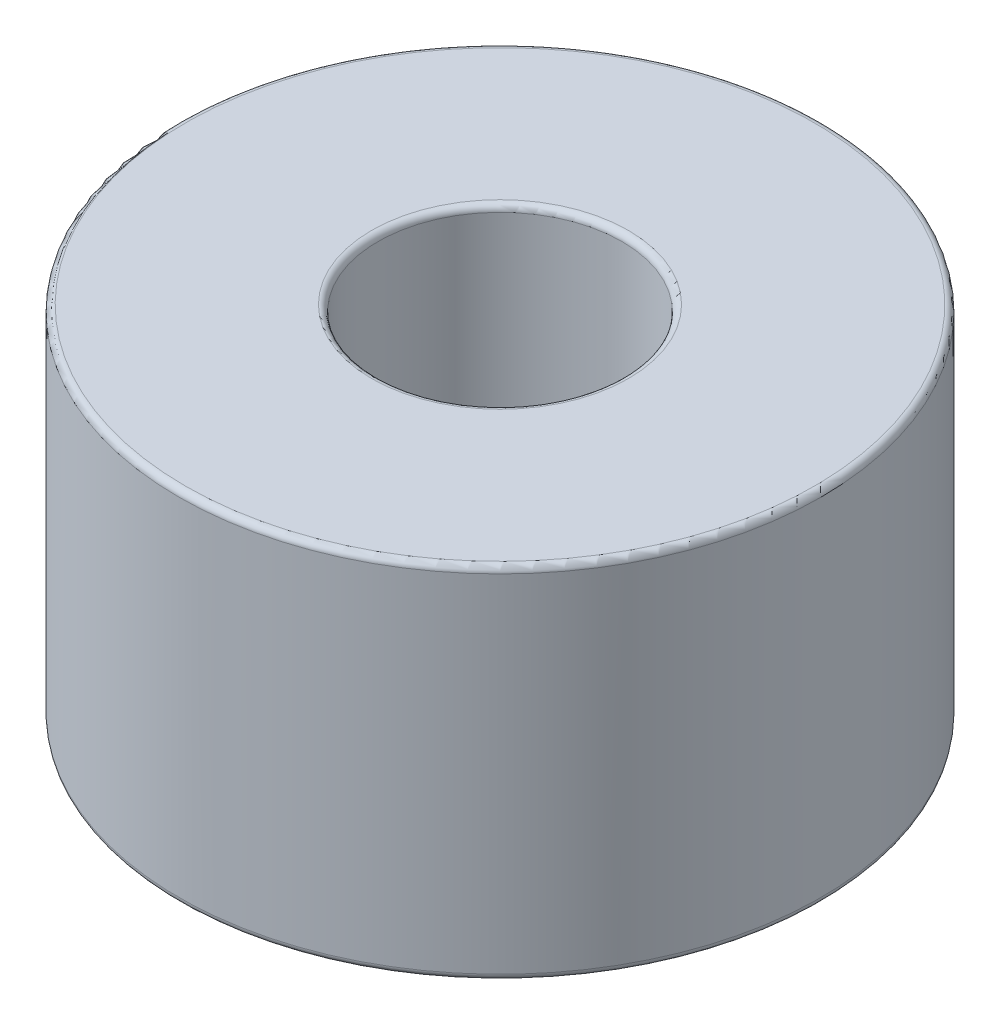
ISO-10303-21;
HEADER;
FILE_DESCRIPTION(('STEP AP214'),'2;1');
FILE_NAME('part.step','',(''),(''),'','','');
FILE_SCHEMA(('AUTOMOTIVE_DESIGN { 1 0 10303 214 1 1 1 1 }'));
ENDSEC;
DATA;
#1=APPLICATION_CONTEXT('core data for automotive mechanical design processes');
#2=APPLICATION_PROTOCOL_DEFINITION('international standard','automotive_design',2000,#1);
#3=PRODUCT_CONTEXT('',#1,'mechanical');
#4=PRODUCT('Part','Part','',(#3));
#5=PRODUCT_RELATED_PRODUCT_CATEGORY('part','',(#4));
#6=PRODUCT_DEFINITION_FORMATION('','',#4);
#7=PRODUCT_DEFINITION_CONTEXT('part definition',#1,'design');
#8=PRODUCT_DEFINITION('design','',#6,#7);
#9=PRODUCT_DEFINITION_SHAPE('','',#8);
#10=(LENGTH_UNIT() NAMED_UNIT(*) SI_UNIT(.MILLI.,.METRE.));
#11=(NAMED_UNIT(*) PLANE_ANGLE_UNIT() SI_UNIT($,.RADIAN.));
#12=(NAMED_UNIT(*) SI_UNIT($,.STERADIAN.) SOLID_ANGLE_UNIT());
#13=UNCERTAINTY_MEASURE_WITH_UNIT(LENGTH_MEASURE(1.E-05),#10,'distance_accuracy_value','');
#14=(GEOMETRIC_REPRESENTATION_CONTEXT(3) GLOBAL_UNCERTAINTY_ASSIGNED_CONTEXT((#13)) GLOBAL_UNIT_ASSIGNED_CONTEXT((#10,
#11,#12)) REPRESENTATION_CONTEXT('',''));
#15=CARTESIAN_POINT('',(0.,0.,0.));
#16=DIRECTION('',(0.,0.,1.));
#17=DIRECTION('',(1.,0.,0.));
#18=AXIS2_PLACEMENT_3D('',#15,#16,#17);
#19=CARTESIAN_POINT('',(0.,0.,0.));
#20=DIRECTION('',(0.,-1.,0.));
#21=DIRECTION('',(0.,0.,-1.));
#22=AXIS2_PLACEMENT_3D('',#19,#20,#21);
#23=CYLINDRICAL_SURFACE('',#22,4.75);
#24=CARTESIAN_POINT('',(0.,0.25,0.));
#25=DIRECTION('',(0.,-1.,0.));
#26=DIRECTION('',(0.,0.,-1.));
#27=AXIS2_PLACEMENT_3D('',#24,#25,#26);
#28=CIRCLE('',#27,4.75);
#29=CARTESIAN_POINT('',(0.,0.25,-4.75));
#30=VERTEX_POINT('',#29);
#31=EDGE_CURVE('E41',#30,#30,#28,.T.);
#32=ORIENTED_EDGE('',*,*,#31,.T.);
#33=EDGE_LOOP('',(#32));
#34=FACE_BOUND('',#33,.T.);
#35=CARTESIAN_POINT('',(0.,13.75,0.));
#36=DIRECTION('',(0.,1.,0.));
#37=DIRECTION('',(0.,0.,1.));
#38=AXIS2_PLACEMENT_3D('',#35,#36,#37);
#39=CIRCLE('',#38,4.75);
#40=CARTESIAN_POINT('',(0.,13.75,4.75));
#41=VERTEX_POINT('',#40);
#42=EDGE_CURVE('E45',#41,#41,#39,.T.);
#43=ORIENTED_EDGE('',*,*,#42,.T.);
#44=EDGE_LOOP('',(#43));
#45=FACE_BOUND('',#44,.T.);
#46=ADVANCED_FACE('F30',(#34,#45),#23,.F.);
#47=CARTESIAN_POINT('',(4.75,0.,0.));
#48=DIRECTION('',(0.,-1.,0.));
#49=DIRECTION('',(0.,0.,-1.));
#50=AXIS2_PLACEMENT_3D('',#47,#48,#49);
#51=PLANE('',#50);
#52=CARTESIAN_POINT('',(0.,0.,0.));
#53=DIRECTION('',(0.,-1.,0.));
#54=DIRECTION('',(0.,0.,-1.));
#55=AXIS2_PLACEMENT_3D('',#52,#53,#54);
#56=CIRCLE('',#55,12.25);
#57=CARTESIAN_POINT('',(0.,0.,-12.25));
#58=VERTEX_POINT('',#57);
#59=EDGE_CURVE('E56',#58,#58,#56,.T.);
#60=ORIENTED_EDGE('',*,*,#59,.T.);
#61=EDGE_LOOP('',(#60));
#62=FACE_BOUND('',#61,.T.);
#63=CARTESIAN_POINT('',(0.,0.,0.));
#64=DIRECTION('',(0.,-1.,0.));
#65=DIRECTION('',(0.,0.,-1.));
#66=AXIS2_PLACEMENT_3D('',#63,#64,#65);
#67=CIRCLE('',#66,5.);
#68=CARTESIAN_POINT('',(0.,0.,-5.));
#69=VERTEX_POINT('',#68);
#70=EDGE_CURVE('E59',#69,#69,#67,.F.);
#71=ORIENTED_EDGE('',*,*,#70,.T.);
#72=EDGE_LOOP('',(#71));
#73=FACE_BOUND('',#72,.T.);
#74=ADVANCED_FACE('F63',(#62,#73),#51,.T.);
#75=CARTESIAN_POINT('',(0.,0.,0.));
#76=DIRECTION('',(0.,-1.,0.));
#77=DIRECTION('',(0.,0.,-1.));
#78=AXIS2_PLACEMENT_3D('',#75,#76,#77);
#79=CYLINDRICAL_SURFACE('',#78,12.5);
#80=CARTESIAN_POINT('',(0.,0.25,0.));
#81=DIRECTION('',(0.,-1.,0.));
#82=DIRECTION('',(0.,0.,-1.));
#83=AXIS2_PLACEMENT_3D('',#80,#81,#82);
#84=CIRCLE('',#83,12.5);
#85=CARTESIAN_POINT('',(0.,0.25,-12.5));
#86=VERTEX_POINT('',#85);
#87=EDGE_CURVE('E50',#86,#86,#84,.F.);
#88=ORIENTED_EDGE('',*,*,#87,.T.);
#89=EDGE_LOOP('',(#88));
#90=FACE_BOUND('',#89,.T.);
#91=CARTESIAN_POINT('',(0.,13.75,0.));
#92=DIRECTION('',(0.,1.,0.));
#93=DIRECTION('',(0.,0.,1.));
#94=AXIS2_PLACEMENT_3D('',#91,#92,#93);
#95=CIRCLE('',#94,12.5);
#96=CARTESIAN_POINT('',(0.,13.75,12.5));
#97=VERTEX_POINT('',#96);
#98=EDGE_CURVE('E53',#97,#97,#95,.F.);
#99=ORIENTED_EDGE('',*,*,#98,.T.);
#100=EDGE_LOOP('',(#99));
#101=FACE_BOUND('',#100,.T.);
#102=ADVANCED_FACE('F91',(#90,#101),#79,.T.);
#103=CARTESIAN_POINT('',(12.5,14.,0.));
#104=DIRECTION('',(0.,1.,0.));
#105=DIRECTION('',(0.,0.,1.));
#106=AXIS2_PLACEMENT_3D('',#103,#104,#105);
#107=PLANE('',#106);
#108=CARTESIAN_POINT('',(0.,14.,0.));
#109=DIRECTION('',(0.,1.,0.));
#110=DIRECTION('',(0.,0.,1.));
#111=AXIS2_PLACEMENT_3D('',#108,#109,#110);
#112=CIRCLE('',#111,5.);
#113=CARTESIAN_POINT('',(0.,14.,5.));
#114=VERTEX_POINT('',#113);
#115=EDGE_CURVE('E10',#114,#114,#112,.F.);
#116=ORIENTED_EDGE('',*,*,#115,.T.);
#117=EDGE_LOOP('',(#116));
#118=FACE_BOUND('',#117,.T.);
#119=CARTESIAN_POINT('',(0.,14.,0.));
#120=DIRECTION('',(0.,1.,0.));
#121=DIRECTION('',(0.,0.,1.));
#122=AXIS2_PLACEMENT_3D('',#119,#120,#121);
#123=CIRCLE('',#122,12.25);
#124=CARTESIAN_POINT('',(0.,14.,12.25));
#125=VERTEX_POINT('',#124);
#126=EDGE_CURVE('E37',#125,#125,#123,.T.);
#127=ORIENTED_EDGE('',*,*,#126,.T.);
#128=EDGE_LOOP('',(#127));
#129=FACE_BOUND('',#128,.T.);
#130=ADVANCED_FACE('F86',(#118,#129),#107,.T.);
#131=CARTESIAN_POINT('',(0.,0.25,0.));
#132=DIRECTION('',(0.,-1.,0.));
#133=DIRECTION('',(0.,0.,-1.));
#134=AXIS2_PLACEMENT_3D('',#131,#132,#133);
#135=TOROIDAL_SURFACE('',#134,12.25,0.25);
#136=ORIENTED_EDGE('',*,*,#87,.F.);
#137=EDGE_LOOP('',(#136));
#138=FACE_BOUND('',#137,.T.);
#139=ORIENTED_EDGE('',*,*,#59,.F.);
#140=EDGE_LOOP('',(#139));
#141=FACE_BOUND('',#140,.T.);
#142=ADVANCED_FACE('F69',(#138,#141),#135,.T.);
#143=CARTESIAN_POINT('',(0.,0.25,0.));
#144=DIRECTION('',(0.,-1.,0.));
#145=DIRECTION('',(0.,0.,-1.));
#146=AXIS2_PLACEMENT_3D('',#143,#144,#145);
#147=TOROIDAL_SURFACE('',#146,5.,0.25);
#148=ORIENTED_EDGE('',*,*,#70,.F.);
#149=EDGE_LOOP('',(#148));
#150=FACE_BOUND('',#149,.T.);
#151=ORIENTED_EDGE('',*,*,#31,.F.);
#152=EDGE_LOOP('',(#151));
#153=FACE_BOUND('',#152,.T.);
#154=ADVANCED_FACE('F65',(#150,#153),#147,.T.);
#155=CARTESIAN_POINT('',(0.,13.75,0.));
#156=DIRECTION('',(0.,1.,0.));
#157=DIRECTION('',(0.,0.,1.));
#158=AXIS2_PLACEMENT_3D('',#155,#156,#157);
#159=TOROIDAL_SURFACE('',#158,5.,0.25);
#160=ORIENTED_EDGE('',*,*,#42,.F.);
#161=EDGE_LOOP('',(#160));
#162=FACE_BOUND('',#161,.T.);
#163=ORIENTED_EDGE('',*,*,#115,.F.);
#164=EDGE_LOOP('',(#163));
#165=FACE_BOUND('',#164,.T.);
#166=ADVANCED_FACE('F68',(#162,#165),#159,.T.);
#167=CARTESIAN_POINT('',(0.,13.75,0.));
#168=DIRECTION('',(0.,1.,0.));
#169=DIRECTION('',(0.,0.,1.));
#170=AXIS2_PLACEMENT_3D('',#167,#168,#169);
#171=TOROIDAL_SURFACE('',#170,12.25,0.25);
#172=ORIENTED_EDGE('',*,*,#126,.F.);
#173=EDGE_LOOP('',(#172));
#174=FACE_BOUND('',#173,.T.);
#175=ORIENTED_EDGE('',*,*,#98,.F.);
#176=EDGE_LOOP('',(#175));
#177=FACE_BOUND('',#176,.T.);
#178=ADVANCED_FACE('F32',(#174,#177),#171,.T.);
#179=CLOSED_SHELL('',(#46,#74,#102,#130,#142,#154,#166,#178));
#180=MANIFOLD_SOLID_BREP('B2',#179);
#181=ADVANCED_BREP_SHAPE_REPRESENTATION('',(#18,#180),#14);
#182=SHAPE_DEFINITION_REPRESENTATION(#9,#181);
ENDSEC;
END-ISO-10303-21;
